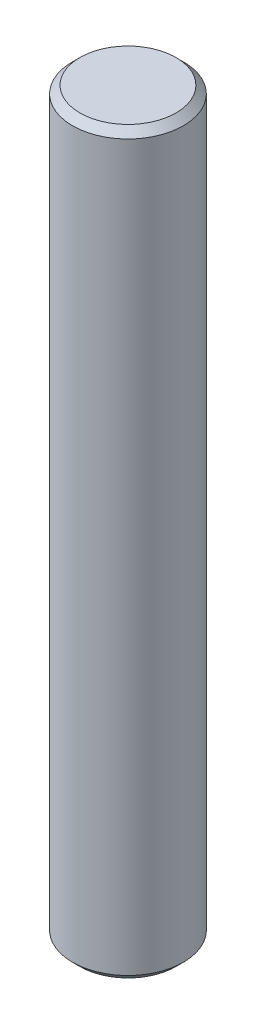
ISO-10303-21;
HEADER;
FILE_DESCRIPTION(('STEP AP214'),'2;1');
FILE_NAME('part.step','',(''),(''),'','','');
FILE_SCHEMA(('AUTOMOTIVE_DESIGN { 1 0 10303 214 1 1 1 1 }'));
ENDSEC;
DATA;
#1=APPLICATION_CONTEXT('core data for automotive mechanical design processes');
#2=APPLICATION_PROTOCOL_DEFINITION('international standard','automotive_design',2000,#1);
#3=PRODUCT_CONTEXT('',#1,'mechanical');
#4=PRODUCT('Part','Part','',(#3));
#5=PRODUCT_RELATED_PRODUCT_CATEGORY('part','',(#4));
#6=PRODUCT_DEFINITION_FORMATION('','',#4);
#7=PRODUCT_DEFINITION_CONTEXT('part definition',#1,'design');
#8=PRODUCT_DEFINITION('design','',#6,#7);
#9=PRODUCT_DEFINITION_SHAPE('','',#8);
#10=(LENGTH_UNIT() NAMED_UNIT(*) SI_UNIT(.MILLI.,.METRE.));
#11=(NAMED_UNIT(*) PLANE_ANGLE_UNIT() SI_UNIT($,.RADIAN.));
#12=(NAMED_UNIT(*) SI_UNIT($,.STERADIAN.) SOLID_ANGLE_UNIT());
#13=UNCERTAINTY_MEASURE_WITH_UNIT(LENGTH_MEASURE(1.E-05),#10,'distance_accuracy_value','');
#14=(GEOMETRIC_REPRESENTATION_CONTEXT(3) GLOBAL_UNCERTAINTY_ASSIGNED_CONTEXT((#13)) GLOBAL_UNIT_ASSIGNED_CONTEXT((#10,
#11,#12)) REPRESENTATION_CONTEXT('',''));
#15=CARTESIAN_POINT('',(0.,0.,0.));
#16=DIRECTION('',(0.,0.,1.));
#17=DIRECTION('',(1.,0.,0.));
#18=AXIS2_PLACEMENT_3D('',#15,#16,#17);
#19=CARTESIAN_POINT('',(0.,20.,0.));
#20=DIRECTION('',(0.,-1.,0.));
#21=DIRECTION('',(0.,0.,-1.));
#22=AXIS2_PLACEMENT_3D('',#19,#20,#21);
#23=CYLINDRICAL_SURFACE('',#22,1.5);
#24=CARTESIAN_POINT('',(0.,0.199999999999999,0.));
#25=DIRECTION('',(0.,1.,0.));
#26=DIRECTION('',(0.,0.,1.));
#27=AXIS2_PLACEMENT_3D('',#24,#25,#26);
#28=CIRCLE('',#27,1.5);
#29=CARTESIAN_POINT('',(0.,0.199999999999999,1.5));
#30=VERTEX_POINT('',#29);
#31=EDGE_CURVE('E34',#30,#30,#28,.T.);
#32=ORIENTED_EDGE('',*,*,#31,.T.);
#33=EDGE_LOOP('',(#32));
#34=FACE_BOUND('',#33,.T.);
#35=CARTESIAN_POINT('',(0.,19.8,0.));
#36=DIRECTION('',(0.,1.,0.));
#37=DIRECTION('',(0.,0.,1.));
#38=AXIS2_PLACEMENT_3D('',#35,#36,#37);
#39=CIRCLE('',#38,1.5);
#40=CARTESIAN_POINT('',(0.,19.8,1.5));
#41=VERTEX_POINT('',#40);
#42=EDGE_CURVE('E38',#41,#41,#39,.F.);
#43=ORIENTED_EDGE('',*,*,#42,.T.);
#44=EDGE_LOOP('',(#43));
#45=FACE_BOUND('',#44,.T.);
#46=ADVANCED_FACE('F24',(#34,#45),#23,.T.);
#47=CARTESIAN_POINT('',(0.,20.,0.));
#48=DIRECTION('',(0.,1.,0.));
#49=DIRECTION('',(0.,0.,1.));
#50=AXIS2_PLACEMENT_3D('',#47,#48,#49);
#51=PLANE('',#50);
#52=CARTESIAN_POINT('',(0.,20.,0.));
#53=DIRECTION('',(0.,1.,0.));
#54=DIRECTION('',(0.,0.,1.));
#55=AXIS2_PLACEMENT_3D('',#52,#53,#54);
#56=CIRCLE('',#55,1.3);
#57=CARTESIAN_POINT('',(0.,20.,1.3));
#58=VERTEX_POINT('',#57);
#59=EDGE_CURVE('E10',#58,#58,#56,.T.);
#60=ORIENTED_EDGE('',*,*,#59,.T.);
#61=EDGE_LOOP('',(#60));
#62=FACE_BOUND('',#61,.T.);
#63=ADVANCED_FACE('F57',(#62),#51,.T.);
#64=CARTESIAN_POINT('',(0.,0.,0.));
#65=DIRECTION('',(0.,1.,0.));
#66=DIRECTION('',(0.,0.,1.));
#67=AXIS2_PLACEMENT_3D('',#64,#65,#66);
#68=PLANE('',#67);
#69=CARTESIAN_POINT('',(0.,0.,0.));
#70=DIRECTION('',(0.,1.,0.));
#71=DIRECTION('',(0.,0.,1.));
#72=AXIS2_PLACEMENT_3D('',#69,#70,#71);
#73=CIRCLE('',#72,1.3);
#74=CARTESIAN_POINT('',(0.,0.,1.3));
#75=VERTEX_POINT('',#74);
#76=EDGE_CURVE('E30',#75,#75,#73,.F.);
#77=ORIENTED_EDGE('',*,*,#76,.T.);
#78=EDGE_LOOP('',(#77));
#79=FACE_BOUND('',#78,.T.);
#80=ADVANCED_FACE('F53',(#79),#68,.F.);
#81=CARTESIAN_POINT('',(0.,0.199999999999999,0.));
#82=DIRECTION('',(0.,1.,0.));
#83=DIRECTION('',(0.,0.,1.));
#84=AXIS2_PLACEMENT_3D('',#81,#82,#83);
#85=CONICAL_SURFACE('',#84,1.5,0.78539816339745);
#86=ORIENTED_EDGE('',*,*,#76,.F.);
#87=EDGE_LOOP('',(#86));
#88=FACE_BOUND('',#87,.T.);
#89=ORIENTED_EDGE('',*,*,#31,.F.);
#90=EDGE_LOOP('',(#89));
#91=FACE_BOUND('',#90,.T.);
#92=ADVANCED_FACE('F48',(#88,#91),#85,.T.);
#93=CARTESIAN_POINT('',(0.,20.,0.));
#94=DIRECTION('',(0.,-1.,0.));
#95=DIRECTION('',(0.,0.,-1.));
#96=AXIS2_PLACEMENT_3D('',#93,#94,#95);
#97=CONICAL_SURFACE('',#96,1.3,0.785398163397454);
#98=ORIENTED_EDGE('',*,*,#42,.F.);
#99=EDGE_LOOP('',(#98));
#100=FACE_BOUND('',#99,.T.);
#101=ORIENTED_EDGE('',*,*,#59,.F.);
#102=EDGE_LOOP('',(#101));
#103=FACE_BOUND('',#102,.T.);
#104=ADVANCED_FACE('F45',(#100,#103),#97,.T.);
#105=CLOSED_SHELL('',(#46,#63,#80,#92,#104));
#106=MANIFOLD_SOLID_BREP('B2',#105);
#107=ADVANCED_BREP_SHAPE_REPRESENTATION('',(#18,#106),#14);
#108=SHAPE_DEFINITION_REPRESENTATION(#9,#107);
ENDSEC;
END-ISO-10303-21;
